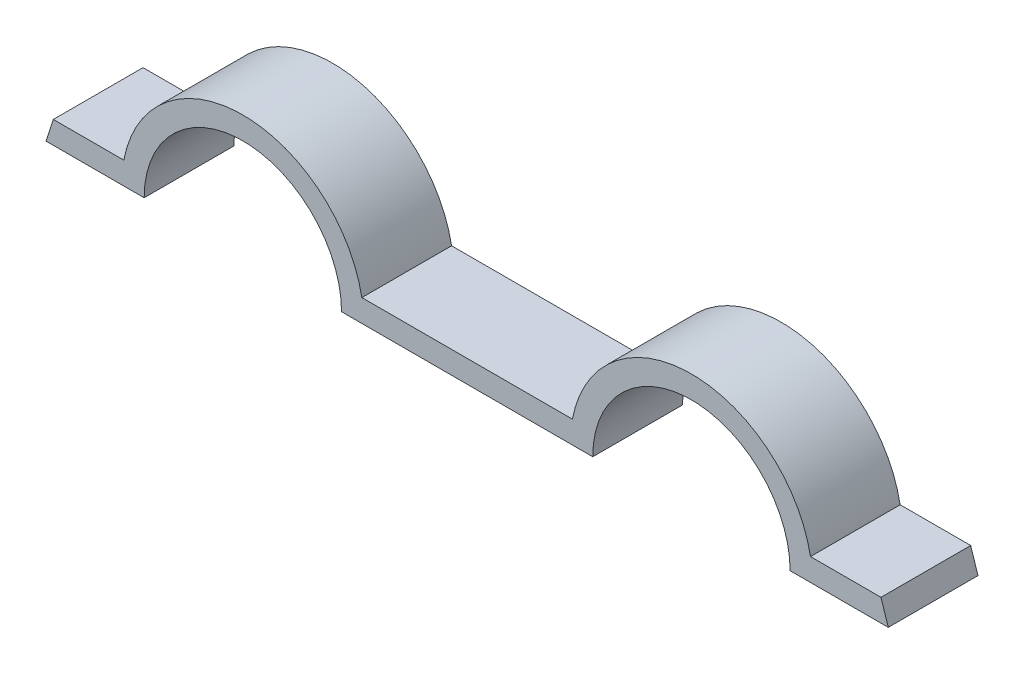
ISO-10303-21;
HEADER;
FILE_DESCRIPTION(('STEP AP214'),'2;1');
FILE_NAME('part.step','',(''),(''),'','','');
FILE_SCHEMA(('AUTOMOTIVE_DESIGN { 1 0 10303 214 1 1 1 1 }'));
ENDSEC;
DATA;
#1=APPLICATION_CONTEXT('core data for automotive mechanical design processes');
#2=APPLICATION_PROTOCOL_DEFINITION('international standard','automotive_design',2000,#1);
#3=PRODUCT_CONTEXT('',#1,'mechanical');
#4=PRODUCT('Part','Part','',(#3));
#5=PRODUCT_RELATED_PRODUCT_CATEGORY('part','',(#4));
#6=PRODUCT_DEFINITION_FORMATION('','',#4);
#7=PRODUCT_DEFINITION_CONTEXT('part definition',#1,'design');
#8=PRODUCT_DEFINITION('design','',#6,#7);
#9=PRODUCT_DEFINITION_SHAPE('','',#8);
#10=(LENGTH_UNIT() NAMED_UNIT(*) SI_UNIT(.MILLI.,.METRE.));
#11=(NAMED_UNIT(*) PLANE_ANGLE_UNIT() SI_UNIT($,.RADIAN.));
#12=(NAMED_UNIT(*) SI_UNIT($,.STERADIAN.) SOLID_ANGLE_UNIT());
#13=UNCERTAINTY_MEASURE_WITH_UNIT(LENGTH_MEASURE(1.E-05),#10,'distance_accuracy_value','');
#14=(GEOMETRIC_REPRESENTATION_CONTEXT(3) GLOBAL_UNCERTAINTY_ASSIGNED_CONTEXT((#13)) GLOBAL_UNIT_ASSIGNED_CONTEXT((#10,
#11,#12)) REPRESENTATION_CONTEXT('',''));
#15=CARTESIAN_POINT('',(0.,0.,0.));
#16=DIRECTION('',(0.,0.,1.));
#17=DIRECTION('',(1.,0.,0.));
#18=AXIS2_PLACEMENT_3D('',#15,#16,#17);
#19=CARTESIAN_POINT('',(-15.875,171.972726707815,6.35));
#20=DIRECTION('',(0.,0.,-1.));
#21=DIRECTION('',(-1.,0.,0.));
#22=AXIS2_PLACEMENT_3D('',#19,#20,#21);
#23=CYLINDRICAL_SURFACE('',#22,6.985);
#24=CARTESIAN_POINT('',(-15.875,171.972726707815,0.));
#25=DIRECTION('',(0.,0.,-1.));
#26=DIRECTION('',(1.,0.,0.));
#27=AXIS2_PLACEMENT_3D('',#24,#25,#26);
#28=CIRCLE('',#27,6.985);
#29=CARTESIAN_POINT('',(-22.86,171.972726707815,0.));
#30=VERTEX_POINT('',#29);
#31=CARTESIAN_POINT('',(-8.89,171.972726707815,0.));
#32=VERTEX_POINT('',#31);
#33=EDGE_CURVE('E156',#30,#32,#28,.T.);
#34=ORIENTED_EDGE('',*,*,#33,.T.);
#35=DIRECTION('',(0.,0.,-1.));
#36=VECTOR('',#35,1.);
#37=CARTESIAN_POINT('',(-8.89,171.972726707815,6.35));
#38=LINE('',#37,#36);
#39=CARTESIAN_POINT('',(-8.89,171.972726707815,6.35));
#40=VERTEX_POINT('',#39);
#41=EDGE_CURVE('E11',#40,#32,#38,.T.);
#42=ORIENTED_EDGE('',*,*,#41,.F.);
#43=CARTESIAN_POINT('',(-15.875,171.972726707815,6.35));
#44=DIRECTION('',(0.,0.,-1.));
#45=DIRECTION('',(1.,0.,0.));
#46=AXIS2_PLACEMENT_3D('',#43,#44,#45);
#47=CIRCLE('',#46,6.985);
#48=CARTESIAN_POINT('',(-22.86,171.972726707815,6.35));
#49=VERTEX_POINT('',#48);
#50=EDGE_CURVE('E178',#49,#40,#47,.T.);
#51=ORIENTED_EDGE('',*,*,#50,.F.);
#52=DIRECTION('',(0.,0.,-1.));
#53=VECTOR('',#52,1.);
#54=CARTESIAN_POINT('',(-22.86,171.972726707815,6.35));
#55=LINE('',#54,#53);
#56=EDGE_CURVE('E152',#49,#30,#55,.T.);
#57=ORIENTED_EDGE('',*,*,#56,.T.);
#58=EDGE_LOOP('',(#34,#42,#51,#57));
#59=FACE_BOUND('',#58,.T.);
#60=ADVANCED_FACE('F36',(#59),#23,.F.);
#61=CARTESIAN_POINT('',(-8.89,171.972726707815,6.35));
#62=DIRECTION('',(0.,1.,0.));
#63=DIRECTION('',(0.,0.,1.));
#64=AXIS2_PLACEMENT_3D('',#61,#62,#63);
#65=PLANE('',#64);
#66=DIRECTION('',(1.,0.,0.));
#67=VECTOR('',#66,1.);
#68=CARTESIAN_POINT('',(-8.89,171.972726707815,0.));
#69=LINE('',#68,#67);
#70=CARTESIAN_POINT('',(8.89,171.972726707815,0.));
#71=VERTEX_POINT('',#70);
#72=EDGE_CURVE('E159',#32,#71,#69,.T.);
#73=ORIENTED_EDGE('',*,*,#72,.T.);
#74=DIRECTION('',(0.,0.,-1.));
#75=VECTOR('',#74,1.);
#76=CARTESIAN_POINT('',(8.89,171.972726707815,6.35));
#77=LINE('',#76,#75);
#78=CARTESIAN_POINT('',(8.89,171.972726707815,6.35));
#79=VERTEX_POINT('',#78);
#80=EDGE_CURVE('E44',#79,#71,#77,.T.);
#81=ORIENTED_EDGE('',*,*,#80,.F.);
#82=DIRECTION('',(1.,0.,0.));
#83=VECTOR('',#82,1.);
#84=CARTESIAN_POINT('',(-8.89,171.972726707815,6.35));
#85=LINE('',#84,#83);
#86=EDGE_CURVE('E107',#40,#79,#85,.T.);
#87=ORIENTED_EDGE('',*,*,#86,.F.);
#88=ORIENTED_EDGE('',*,*,#41,.T.);
#89=EDGE_LOOP('',(#73,#81,#87,#88));
#90=FACE_BOUND('',#89,.T.);
#91=ADVANCED_FACE('F256',(#90),#65,.F.);
#92=CARTESIAN_POINT('',(15.875,171.972726707815,6.35));
#93=DIRECTION('',(0.,0.,-1.));
#94=DIRECTION('',(-1.,0.,0.));
#95=AXIS2_PLACEMENT_3D('',#92,#93,#94);
#96=CYLINDRICAL_SURFACE('',#95,6.985);
#97=CARTESIAN_POINT('',(15.875,171.972726707815,0.));
#98=DIRECTION('',(0.,0.,-1.));
#99=DIRECTION('',(-1.,0.,0.));
#100=AXIS2_PLACEMENT_3D('',#97,#98,#99);
#101=CIRCLE('',#100,6.985);
#102=CARTESIAN_POINT('',(22.86,171.972726707815,0.));
#103=VERTEX_POINT('',#102);
#104=EDGE_CURVE('E161',#71,#103,#101,.T.);
#105=ORIENTED_EDGE('',*,*,#104,.T.);
#106=DIRECTION('',(0.,0.,-1.));
#107=VECTOR('',#106,1.);
#108=CARTESIAN_POINT('',(22.86,171.972726707815,6.35));
#109=LINE('',#108,#107);
#110=CARTESIAN_POINT('',(22.86,171.972726707815,6.35));
#111=VERTEX_POINT('',#110);
#112=EDGE_CURVE('E197',#111,#103,#109,.T.);
#113=ORIENTED_EDGE('',*,*,#112,.F.);
#114=CARTESIAN_POINT('',(15.875,171.972726707815,6.35));
#115=DIRECTION('',(0.,0.,-1.));
#116=DIRECTION('',(-1.,0.,0.));
#117=AXIS2_PLACEMENT_3D('',#114,#115,#116);
#118=CIRCLE('',#117,6.985);
#119=EDGE_CURVE('E205',#79,#111,#118,.T.);
#120=ORIENTED_EDGE('',*,*,#119,.F.);
#121=ORIENTED_EDGE('',*,*,#80,.T.);
#122=EDGE_LOOP('',(#105,#113,#120,#121));
#123=FACE_BOUND('',#122,.T.);
#124=ADVANCED_FACE('F203',(#123),#96,.F.);
#125=CARTESIAN_POINT('',(29.8065433367642,171.972726707815,6.35));
#126=DIRECTION('',(0.,1.,0.));
#127=DIRECTION('',(0.,0.,1.));
#128=AXIS2_PLACEMENT_3D('',#125,#126,#127);
#129=PLANE('',#128);
#130=DIRECTION('',(1.,0.,0.));
#131=VECTOR('',#130,1.);
#132=CARTESIAN_POINT('',(29.8065433367642,171.972726707815,0.));
#133=LINE('',#132,#131);
#134=CARTESIAN_POINT('',(29.8065433367642,171.972726707815,0.));
#135=VERTEX_POINT('',#134);
#136=EDGE_CURVE('E163',#103,#135,#133,.T.);
#137=ORIENTED_EDGE('',*,*,#136,.T.);
#138=DIRECTION('',(0.,0.,-1.));
#139=VECTOR('',#138,1.);
#140=CARTESIAN_POINT('',(29.8065433367642,171.972726707815,6.35));
#141=LINE('',#140,#139);
#142=CARTESIAN_POINT('',(29.8065433367642,171.972726707815,6.35));
#143=VERTEX_POINT('',#142);
#144=EDGE_CURVE('E194',#143,#135,#141,.T.);
#145=ORIENTED_EDGE('',*,*,#144,.F.);
#146=DIRECTION('',(1.,0.,0.));
#147=VECTOR('',#146,1.);
#148=CARTESIAN_POINT('',(29.8065433367642,171.972726707815,6.35));
#149=LINE('',#148,#147);
#150=EDGE_CURVE('E223',#111,#143,#149,.T.);
#151=ORIENTED_EDGE('',*,*,#150,.F.);
#152=ORIENTED_EDGE('',*,*,#112,.T.);
#153=EDGE_LOOP('',(#137,#145,#151,#152));
#154=FACE_BOUND('',#153,.T.);
#155=ADVANCED_FACE('F214',(#154),#129,.F.);
#156=CARTESIAN_POINT('',(29.2900362574069,173.560226707815,6.35));
#157=DIRECTION('',(-0.950933726670703,-0.309394646818863,0.));
#158=DIRECTION('',(0.309394646818863,-0.950933726670703,0.));
#159=AXIS2_PLACEMENT_3D('',#156,#157,#158);
#160=PLANE('',#159);
#161=DIRECTION('',(-0.309394646818863,0.950933726670703,0.));
#162=VECTOR('',#161,1.);
#163=CARTESIAN_POINT('',(29.2900362574069,173.560226707815,0.));
#164=LINE('',#163,#162);
#165=CARTESIAN_POINT('',(29.2900362574069,173.560226707815,0.));
#166=VERTEX_POINT('',#165);
#167=EDGE_CURVE('E165',#135,#166,#164,.T.);
#168=ORIENTED_EDGE('',*,*,#167,.T.);
#169=DIRECTION('',(0.,0.,-1.));
#170=VECTOR('',#169,1.);
#171=CARTESIAN_POINT('',(29.2900362574069,173.560226707815,6.35));
#172=LINE('',#171,#170);
#173=CARTESIAN_POINT('',(29.2900362574069,173.560226707815,6.35));
#174=VERTEX_POINT('',#173);
#175=EDGE_CURVE('E191',#174,#166,#172,.T.);
#176=ORIENTED_EDGE('',*,*,#175,.F.);
#177=DIRECTION('',(-0.309394646818863,0.950933726670703,0.));
#178=VECTOR('',#177,1.);
#179=CARTESIAN_POINT('',(29.2900362574069,173.560226707815,6.35));
#180=LINE('',#179,#178);
#181=EDGE_CURVE('E220',#143,#174,#180,.T.);
#182=ORIENTED_EDGE('',*,*,#181,.F.);
#183=ORIENTED_EDGE('',*,*,#144,.T.);
#184=EDGE_LOOP('',(#168,#176,#182,#183));
#185=FACE_BOUND('',#184,.T.);
#186=ADVANCED_FACE('F218',(#185),#160,.F.);
#187=CARTESIAN_POINT('',(29.2900362574069,173.560226707815,6.35));
#188=DIRECTION('',(0.,-1.,0.));
#189=DIRECTION('',(0.,0.,-1.));
#190=AXIS2_PLACEMENT_3D('',#187,#188,#189);
#191=PLANE('',#190);
#192=DIRECTION('',(-1.,0.,0.));
#193=VECTOR('',#192,1.);
#194=CARTESIAN_POINT('',(29.2900362574069,173.560226707815,0.));
#195=LINE('',#194,#193);
#196=CARTESIAN_POINT('',(24.2992269675027,173.560226707815,0.));
#197=VERTEX_POINT('',#196);
#198=EDGE_CURVE('E167',#166,#197,#195,.T.);
#199=ORIENTED_EDGE('',*,*,#198,.T.);
#200=DIRECTION('',(0.,0.,-1.));
#201=VECTOR('',#200,1.);
#202=CARTESIAN_POINT('',(24.2992269675027,173.560226707815,6.35));
#203=LINE('',#202,#201);
#204=CARTESIAN_POINT('',(24.2992269675027,173.560226707815,6.35));
#205=VERTEX_POINT('',#204);
#206=EDGE_CURVE('E188',#205,#197,#203,.T.);
#207=ORIENTED_EDGE('',*,*,#206,.F.);
#208=DIRECTION('',(-1.,0.,0.));
#209=VECTOR('',#208,1.);
#210=CARTESIAN_POINT('',(29.2900362574069,173.560226707815,6.35));
#211=LINE('',#210,#209);
#212=EDGE_CURVE('E222',#174,#205,#211,.T.);
#213=ORIENTED_EDGE('',*,*,#212,.F.);
#214=ORIENTED_EDGE('',*,*,#175,.T.);
#215=EDGE_LOOP('',(#199,#207,#213,#214));
#216=FACE_BOUND('',#215,.T.);
#217=ADVANCED_FACE('F269',(#216),#191,.F.);
#218=CARTESIAN_POINT('',(15.875,171.972726707815,6.35));
#219=DIRECTION('',(0.,0.,-1.));
#220=DIRECTION('',(-1.,0.,0.));
#221=AXIS2_PLACEMENT_3D('',#218,#219,#220);
#222=CYLINDRICAL_SURFACE('',#221,8.5725);
#223=CARTESIAN_POINT('',(15.875,171.972726707815,0.));
#224=DIRECTION('',(0.,0.,1.));
#225=DIRECTION('',(-1.,0.,0.));
#226=AXIS2_PLACEMENT_3D('',#223,#224,#225);
#227=CIRCLE('',#226,8.5725);
#228=CARTESIAN_POINT('',(7.45077303249729,173.560226707815,0.));
#229=VERTEX_POINT('',#228);
#230=EDGE_CURVE('E169',#197,#229,#227,.T.);
#231=ORIENTED_EDGE('',*,*,#230,.T.);
#232=DIRECTION('',(0.,0.,-1.));
#233=VECTOR('',#232,1.);
#234=CARTESIAN_POINT('',(7.45077303249729,173.560226707815,6.35));
#235=LINE('',#234,#233);
#236=CARTESIAN_POINT('',(7.45077303249729,173.560226707815,6.35));
#237=VERTEX_POINT('',#236);
#238=EDGE_CURVE('E185',#237,#229,#235,.T.);
#239=ORIENTED_EDGE('',*,*,#238,.F.);
#240=CARTESIAN_POINT('',(15.875,171.972726707815,6.35));
#241=DIRECTION('',(0.,0.,1.));
#242=DIRECTION('',(-1.,0.,0.));
#243=AXIS2_PLACEMENT_3D('',#240,#241,#242);
#244=CIRCLE('',#243,8.5725);
#245=EDGE_CURVE('E225',#205,#237,#244,.T.);
#246=ORIENTED_EDGE('',*,*,#245,.F.);
#247=ORIENTED_EDGE('',*,*,#206,.T.);
#248=EDGE_LOOP('',(#231,#239,#246,#247));
#249=FACE_BOUND('',#248,.T.);
#250=ADVANCED_FACE('F272',(#249),#222,.T.);
#251=CARTESIAN_POINT('',(-7.45077303249729,173.560226707815,6.35));
#252=DIRECTION('',(0.,-1.,0.));
#253=DIRECTION('',(0.,0.,-1.));
#254=AXIS2_PLACEMENT_3D('',#251,#252,#253);
#255=PLANE('',#254);
#256=DIRECTION('',(-1.,0.,0.));
#257=VECTOR('',#256,1.);
#258=CARTESIAN_POINT('',(-7.45077303249729,173.560226707815,0.));
#259=LINE('',#258,#257);
#260=CARTESIAN_POINT('',(-7.45077303249729,173.560226707815,0.));
#261=VERTEX_POINT('',#260);
#262=EDGE_CURVE('E171',#229,#261,#259,.T.);
#263=ORIENTED_EDGE('',*,*,#262,.T.);
#264=DIRECTION('',(0.,0.,-1.));
#265=VECTOR('',#264,1.);
#266=CARTESIAN_POINT('',(-7.45077303249729,173.560226707815,6.35));
#267=LINE('',#266,#265);
#268=CARTESIAN_POINT('',(-7.45077303249729,173.560226707815,6.35));
#269=VERTEX_POINT('',#268);
#270=EDGE_CURVE('E182',#269,#261,#267,.T.);
#271=ORIENTED_EDGE('',*,*,#270,.F.);
#272=DIRECTION('',(-1.,0.,0.));
#273=VECTOR('',#272,1.);
#274=CARTESIAN_POINT('',(-7.45077303249729,173.560226707815,6.35));
#275=LINE('',#274,#273);
#276=EDGE_CURVE('E231',#237,#269,#275,.T.);
#277=ORIENTED_EDGE('',*,*,#276,.F.);
#278=ORIENTED_EDGE('',*,*,#238,.T.);
#279=EDGE_LOOP('',(#263,#271,#277,#278));
#280=FACE_BOUND('',#279,.T.);
#281=ADVANCED_FACE('F237',(#280),#255,.F.);
#282=CARTESIAN_POINT('',(-15.875,171.972726707815,6.35));
#283=DIRECTION('',(0.,0.,-1.));
#284=DIRECTION('',(-1.,0.,0.));
#285=AXIS2_PLACEMENT_3D('',#282,#283,#284);
#286=CYLINDRICAL_SURFACE('',#285,8.5725);
#287=CARTESIAN_POINT('',(-15.875,171.972726707815,0.));
#288=DIRECTION('',(0.,0.,1.));
#289=DIRECTION('',(1.,0.,0.));
#290=AXIS2_PLACEMENT_3D('',#287,#288,#289);
#291=CIRCLE('',#290,8.5725);
#292=CARTESIAN_POINT('',(-24.2992269675027,173.560226707815,0.));
#293=VERTEX_POINT('',#292);
#294=EDGE_CURVE('E173',#261,#293,#291,.T.);
#295=ORIENTED_EDGE('',*,*,#294,.T.);
#296=DIRECTION('',(0.,0.,-1.));
#297=VECTOR('',#296,1.);
#298=CARTESIAN_POINT('',(-24.2992269675027,173.560226707815,6.35));
#299=LINE('',#298,#297);
#300=CARTESIAN_POINT('',(-24.2992269675027,173.560226707815,6.35));
#301=VERTEX_POINT('',#300);
#302=EDGE_CURVE('E147',#301,#293,#299,.T.);
#303=ORIENTED_EDGE('',*,*,#302,.F.);
#304=CARTESIAN_POINT('',(-15.875,171.972726707815,6.35));
#305=DIRECTION('',(0.,0.,1.));
#306=DIRECTION('',(1.,0.,0.));
#307=AXIS2_PLACEMENT_3D('',#304,#305,#306);
#308=CIRCLE('',#307,8.5725);
#309=EDGE_CURVE('E138',#269,#301,#308,.T.);
#310=ORIENTED_EDGE('',*,*,#309,.F.);
#311=ORIENTED_EDGE('',*,*,#270,.T.);
#312=EDGE_LOOP('',(#295,#303,#310,#311));
#313=FACE_BOUND('',#312,.T.);
#314=ADVANCED_FACE('F241',(#313),#286,.T.);
#315=CARTESIAN_POINT('',(-29.2900362574069,173.560226707815,6.35));
#316=DIRECTION('',(0.,-1.,0.));
#317=DIRECTION('',(0.,0.,-1.));
#318=AXIS2_PLACEMENT_3D('',#315,#316,#317);
#319=PLANE('',#318);
#320=DIRECTION('',(-1.,0.,0.));
#321=VECTOR('',#320,1.);
#322=CARTESIAN_POINT('',(-29.2900362574069,173.560226707815,0.));
#323=LINE('',#322,#321);
#324=CARTESIAN_POINT('',(-29.2900362574069,173.560226707815,0.));
#325=VERTEX_POINT('',#324);
#326=EDGE_CURVE('E146',#293,#325,#323,.T.);
#327=ORIENTED_EDGE('',*,*,#326,.T.);
#328=DIRECTION('',(0.,0.,-1.));
#329=VECTOR('',#328,1.);
#330=CARTESIAN_POINT('',(-29.2900362574069,173.560226707815,6.35));
#331=LINE('',#330,#329);
#332=CARTESIAN_POINT('',(-29.2900362574069,173.560226707815,6.35));
#333=VERTEX_POINT('',#332);
#334=EDGE_CURVE('E143',#333,#325,#331,.T.);
#335=ORIENTED_EDGE('',*,*,#334,.F.);
#336=DIRECTION('',(-1.,0.,0.));
#337=VECTOR('',#336,1.);
#338=CARTESIAN_POINT('',(-29.2900362574069,173.560226707815,6.35));
#339=LINE('',#338,#337);
#340=EDGE_CURVE('E132',#301,#333,#339,.T.);
#341=ORIENTED_EDGE('',*,*,#340,.F.);
#342=ORIENTED_EDGE('',*,*,#302,.T.);
#343=EDGE_LOOP('',(#327,#335,#341,#342));
#344=FACE_BOUND('',#343,.T.);
#345=ADVANCED_FACE('F144',(#344),#319,.F.);
#346=CARTESIAN_POINT('',(-29.2900362574069,173.560226707815,6.35));
#347=DIRECTION('',(0.950933726670703,-0.309394646818863,0.));
#348=DIRECTION('',(0.309394646818863,0.950933726670703,0.));
#349=AXIS2_PLACEMENT_3D('',#346,#347,#348);
#350=PLANE('',#349);
#351=DIRECTION('',(-0.309394646818863,-0.950933726670703,0.));
#352=VECTOR('',#351,1.);
#353=CARTESIAN_POINT('',(-29.2900362574069,173.560226707815,0.));
#354=LINE('',#353,#352);
#355=CARTESIAN_POINT('',(-29.8065433367642,171.972726707815,0.));
#356=VERTEX_POINT('',#355);
#357=EDGE_CURVE('E93',#325,#356,#354,.T.);
#358=ORIENTED_EDGE('',*,*,#357,.T.);
#359=DIRECTION('',(0.,0.,-1.));
#360=VECTOR('',#359,1.);
#361=CARTESIAN_POINT('',(-29.8065433367642,171.972726707815,6.35));
#362=LINE('',#361,#360);
#363=CARTESIAN_POINT('',(-29.8065433367642,171.972726707815,6.35));
#364=VERTEX_POINT('',#363);
#365=EDGE_CURVE('E148',#364,#356,#362,.T.);
#366=ORIENTED_EDGE('',*,*,#365,.F.);
#367=DIRECTION('',(-0.309394646818863,-0.950933726670703,0.));
#368=VECTOR('',#367,1.);
#369=CARTESIAN_POINT('',(-29.2900362574069,173.560226707815,6.35));
#370=LINE('',#369,#368);
#371=EDGE_CURVE('E136',#333,#364,#370,.T.);
#372=ORIENTED_EDGE('',*,*,#371,.F.);
#373=ORIENTED_EDGE('',*,*,#334,.T.);
#374=EDGE_LOOP('',(#358,#366,#372,#373));
#375=FACE_BOUND('',#374,.T.);
#376=ADVANCED_FACE('F150',(#375),#350,.F.);
#377=CARTESIAN_POINT('',(-29.8065433367642,171.972726707815,6.35));
#378=DIRECTION('',(0.,1.,0.));
#379=DIRECTION('',(0.,0.,1.));
#380=AXIS2_PLACEMENT_3D('',#377,#378,#379);
#381=PLANE('',#380);
#382=DIRECTION('',(1.,0.,0.));
#383=VECTOR('',#382,1.);
#384=CARTESIAN_POINT('',(-29.8065433367642,171.972726707815,0.));
#385=LINE('',#384,#383);
#386=EDGE_CURVE('E99',#356,#30,#385,.T.);
#387=ORIENTED_EDGE('',*,*,#386,.T.);
#388=ORIENTED_EDGE('',*,*,#56,.F.);
#389=DIRECTION('',(1.,0.,0.));
#390=VECTOR('',#389,1.);
#391=CARTESIAN_POINT('',(-29.8065433367642,171.972726707815,6.35));
#392=LINE('',#391,#390);
#393=EDGE_CURVE('E52',#364,#49,#392,.T.);
#394=ORIENTED_EDGE('',*,*,#393,.F.);
#395=ORIENTED_EDGE('',*,*,#365,.T.);
#396=EDGE_LOOP('',(#387,#388,#394,#395));
#397=FACE_BOUND('',#396,.T.);
#398=ADVANCED_FACE('F245',(#397),#381,.F.);
#399=CARTESIAN_POINT('',(-15.875,171.972726707815,6.35));
#400=DIRECTION('',(0.,0.,1.));
#401=DIRECTION('',(1.,0.,0.));
#402=AXIS2_PLACEMENT_3D('',#399,#400,#401);
#403=PLANE('',#402);
#404=ORIENTED_EDGE('',*,*,#50,.T.);
#405=ORIENTED_EDGE('',*,*,#86,.T.);
#406=ORIENTED_EDGE('',*,*,#119,.T.);
#407=ORIENTED_EDGE('',*,*,#150,.T.);
#408=ORIENTED_EDGE('',*,*,#181,.T.);
#409=ORIENTED_EDGE('',*,*,#212,.T.);
#410=ORIENTED_EDGE('',*,*,#245,.T.);
#411=ORIENTED_EDGE('',*,*,#276,.T.);
#412=ORIENTED_EDGE('',*,*,#309,.T.);
#413=ORIENTED_EDGE('',*,*,#340,.T.);
#414=ORIENTED_EDGE('',*,*,#371,.T.);
#415=ORIENTED_EDGE('',*,*,#393,.T.);
#416=EDGE_LOOP('',(#404,#405,#406,#407,#408,#409,#410,#411,#412,#413,#414,#415));
#417=FACE_BOUND('',#416,.T.);
#418=ADVANCED_FACE('F134',(#417),#403,.T.);
#419=CARTESIAN_POINT('',(-15.875,171.972726707815,0.));
#420=DIRECTION('',(0.,0.,1.));
#421=DIRECTION('',(1.,0.,0.));
#422=AXIS2_PLACEMENT_3D('',#419,#420,#421);
#423=PLANE('',#422);
#424=ORIENTED_EDGE('',*,*,#33,.F.);
#425=ORIENTED_EDGE('',*,*,#386,.F.);
#426=ORIENTED_EDGE('',*,*,#357,.F.);
#427=ORIENTED_EDGE('',*,*,#326,.F.);
#428=ORIENTED_EDGE('',*,*,#294,.F.);
#429=ORIENTED_EDGE('',*,*,#262,.F.);
#430=ORIENTED_EDGE('',*,*,#230,.F.);
#431=ORIENTED_EDGE('',*,*,#198,.F.);
#432=ORIENTED_EDGE('',*,*,#167,.F.);
#433=ORIENTED_EDGE('',*,*,#136,.F.);
#434=ORIENTED_EDGE('',*,*,#104,.F.);
#435=ORIENTED_EDGE('',*,*,#72,.F.);
#436=EDGE_LOOP('',(#424,#425,#426,#427,#428,#429,#430,#431,#432,#433,#434,#435));
#437=FACE_BOUND('',#436,.T.);
#438=ADVANCED_FACE('F209',(#437),#423,.F.);
#439=CLOSED_SHELL('',(#60,#91,#124,#155,#186,#217,#250,#281,#314,#345,#376,#398,#418,#438));
#440=MANIFOLD_SOLID_BREP('B2',#439);
#441=ADVANCED_BREP_SHAPE_REPRESENTATION('',(#18,#440),#14);
#442=SHAPE_DEFINITION_REPRESENTATION(#9,#441);
ENDSEC;
END-ISO-10303-21;
